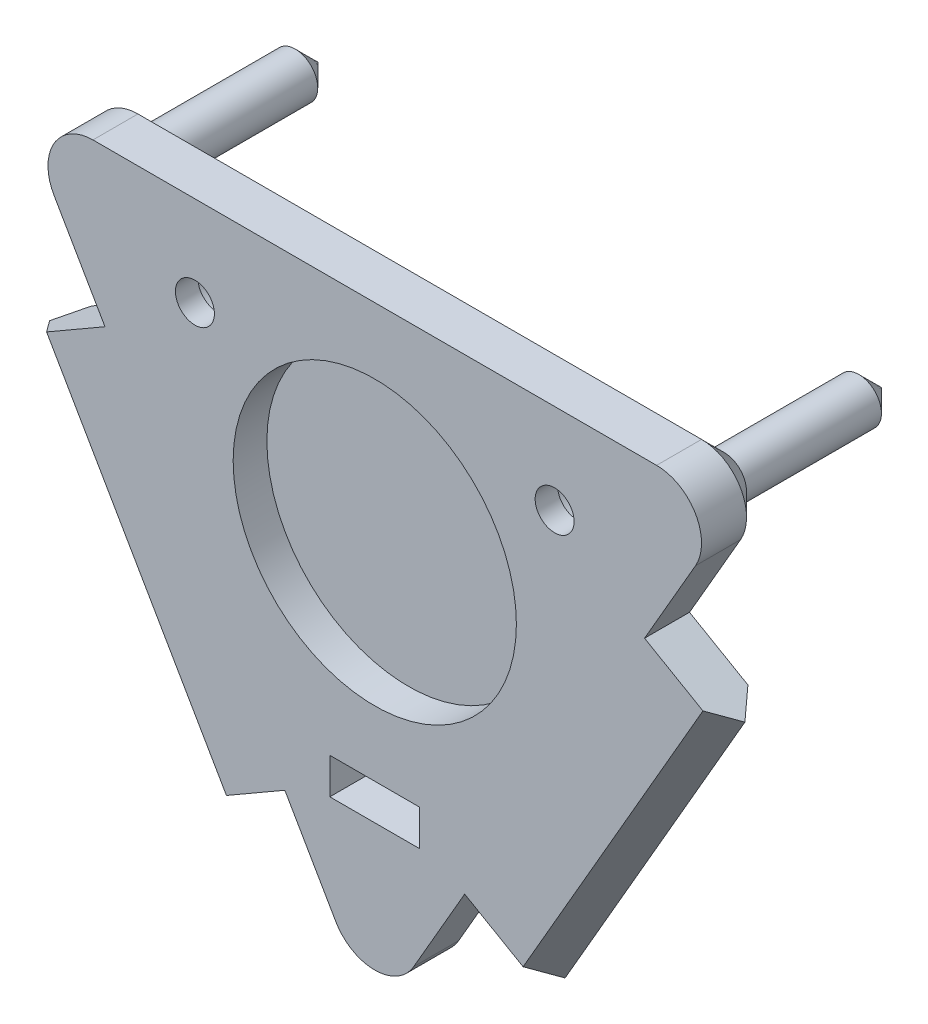
ISO-10303-21;
HEADER;
FILE_DESCRIPTION(('STEP AP214'),'2;1');
FILE_NAME('part.step','',(''),(''),'','','');
FILE_SCHEMA(('AUTOMOTIVE_DESIGN { 1 0 10303 214 1 1 1 1 }'));
ENDSEC;
DATA;
#1=APPLICATION_CONTEXT('core data for automotive mechanical design processes');
#2=APPLICATION_PROTOCOL_DEFINITION('international standard','automotive_design',2000,#1);
#3=PRODUCT_CONTEXT('',#1,'mechanical');
#4=PRODUCT('Part','Part','',(#3));
#5=PRODUCT_RELATED_PRODUCT_CATEGORY('part','',(#4));
#6=PRODUCT_DEFINITION_FORMATION('','',#4);
#7=PRODUCT_DEFINITION_CONTEXT('part definition',#1,'design');
#8=PRODUCT_DEFINITION('design','',#6,#7);
#9=PRODUCT_DEFINITION_SHAPE('','',#8);
#10=(LENGTH_UNIT() NAMED_UNIT(*) SI_UNIT(.MILLI.,.METRE.));
#11=(NAMED_UNIT(*) PLANE_ANGLE_UNIT() SI_UNIT($,.RADIAN.));
#12=(NAMED_UNIT(*) SI_UNIT($,.STERADIAN.) SOLID_ANGLE_UNIT());
#13=UNCERTAINTY_MEASURE_WITH_UNIT(LENGTH_MEASURE(1.E-05),#10,'distance_accuracy_value','');
#14=(GEOMETRIC_REPRESENTATION_CONTEXT(3) GLOBAL_UNCERTAINTY_ASSIGNED_CONTEXT((#13)) GLOBAL_UNIT_ASSIGNED_CONTEXT((#10,
#11,#12)) REPRESENTATION_CONTEXT('',''));
#15=CARTESIAN_POINT('',(0.,0.,0.));
#16=DIRECTION('',(0.,0.,1.));
#17=DIRECTION('',(1.,0.,0.));
#18=AXIS2_PLACEMENT_3D('',#15,#16,#17);
#19=CARTESIAN_POINT('',(50.7999999999999,29.329393674833,3.175));
#20=DIRECTION('',(-0.866025403784439,0.5,0.));
#21=DIRECTION('',(-0.5,-0.866025403784439,0.));
#22=AXIS2_PLACEMENT_3D('',#19,#20,#21);
#23=PLANE('',#22);
#24=DIRECTION('',(0.,0.,1.));
#25=VECTOR('',#24,1.);
#26=CARTESIAN_POINT('',(38.1000000000001,7.33234841870829,-65.2989076283128));
#27=LINE('',#26,#25);
#28=CARTESIAN_POINT('',(38.1000000000001,7.33234841870829,-3.175));
#29=VERTEX_POINT('',#28);
#30=CARTESIAN_POINT('',(38.1,7.33234841870833,3.175));
#31=VERTEX_POINT('',#30);
#32=EDGE_CURVE('E203',#29,#31,#27,.T.);
#33=ORIENTED_EDGE('',*,*,#32,.F.);
#34=DIRECTION('',(0.5,0.866025403784439,0.));
#35=VECTOR('',#34,1.);
#36=CARTESIAN_POINT('',(50.7999999999999,29.329393674833,-3.175));
#37=LINE('',#36,#35);
#38=CARTESIAN_POINT('',(45.3007386859688,19.804393674833,-3.175));
#39=VERTEX_POINT('',#38);
#40=EDGE_CURVE('E187',#29,#39,#37,.T.);
#41=ORIENTED_EDGE('',*,*,#40,.T.);
#42=DIRECTION('',(0.,0.,-1.));
#43=VECTOR('',#42,1.);
#44=CARTESIAN_POINT('',(45.3007386859688,19.804393674833,3.175));
#45=LINE('',#44,#43);
#46=CARTESIAN_POINT('',(45.3007386859688,19.804393674833,3.175));
#47=VERTEX_POINT('',#46);
#48=EDGE_CURVE('E322',#39,#47,#45,.F.);
#49=ORIENTED_EDGE('',*,*,#48,.T.);
#50=DIRECTION('',(0.5,0.866025403784439,0.));
#51=VECTOR('',#50,1.);
#52=CARTESIAN_POINT('',(50.7999999999999,29.329393674833,3.175));
#53=LINE('',#52,#51);
#54=EDGE_CURVE('E204',#31,#47,#53,.T.);
#55=ORIENTED_EDGE('',*,*,#54,.F.);
#56=EDGE_LOOP('',(#33,#41,#49,#55));
#57=FACE_BOUND('',#56,.T.);
#58=ADVANCED_FACE('F39',(#57),#23,.F.);
#59=DIRECTION('',(0.,0.,1.));
#60=VECTOR('',#59,1.);
#61=CARTESIAN_POINT('',(12.7000000000001,-36.6617420935412,-65.2989076283128));
#62=LINE('',#61,#60);
#63=CARTESIAN_POINT('',(12.7,-36.6617420935411,-3.175));
#64=VERTEX_POINT('',#63);
#65=CARTESIAN_POINT('',(12.7,-36.6617420935411,3.175));
#66=VERTEX_POINT('',#65);
#67=EDGE_CURVE('E210',#64,#66,#62,.T.);
#68=ORIENTED_EDGE('',*,*,#67,.T.);
#69=CARTESIAN_POINT('',(5.49926131403112,-49.133787349666,3.175));
#70=VERTEX_POINT('',#69);
#71=EDGE_CURVE('E288',#70,#66,#53,.T.);
#72=ORIENTED_EDGE('',*,*,#71,.F.);
#73=DIRECTION('',(0.,0.,-1.));
#74=VECTOR('',#73,1.);
#75=CARTESIAN_POINT('',(5.49926131403113,-49.133787349666,3.175));
#76=LINE('',#75,#74);
#77=CARTESIAN_POINT('',(5.49926131403112,-49.133787349666,-3.175));
#78=VERTEX_POINT('',#77);
#79=EDGE_CURVE('E324',#70,#78,#76,.T.);
#80=ORIENTED_EDGE('',*,*,#79,.T.);
#81=EDGE_CURVE('E199',#78,#64,#37,.T.);
#82=ORIENTED_EDGE('',*,*,#81,.T.);
#83=EDGE_LOOP('',(#68,#72,#80,#82));
#84=FACE_BOUND('',#83,.T.);
#85=ADVANCED_FACE('F397',(#84),#23,.F.);
#86=CARTESIAN_POINT('',(0.,-58.6587873496659,3.175));
#87=DIRECTION('',(0.866025403784439,0.5,0.));
#88=DIRECTION('',(-0.5,0.866025403784439,0.));
#89=AXIS2_PLACEMENT_3D('',#86,#87,#88);
#90=PLANE('',#89);
#91=DIRECTION('',(0.5,-0.866025403784439,0.));
#92=VECTOR('',#91,1.);
#93=CARTESIAN_POINT('',(0.,-58.6587873496659,3.175));
#94=LINE('',#93,#92);
#95=CARTESIAN_POINT('',(-12.7000000000001,-36.6617420935412,3.175));
#96=VERTEX_POINT('',#95);
#97=CARTESIAN_POINT('',(-5.49926131403124,-49.133787349666,3.175));
#98=VERTEX_POINT('',#97);
#99=EDGE_CURVE('E284',#96,#98,#94,.T.);
#100=ORIENTED_EDGE('',*,*,#99,.F.);
#101=DIRECTION('',(0.,0.,1.));
#102=VECTOR('',#101,1.);
#103=CARTESIAN_POINT('',(-12.7000000000001,-36.6617420935412,-65.2989076283128));
#104=LINE('',#103,#102);
#105=CARTESIAN_POINT('',(-12.7000000000001,-36.6617420935412,-3.175));
#106=VERTEX_POINT('',#105);
#107=EDGE_CURVE('E231',#106,#96,#104,.T.);
#108=ORIENTED_EDGE('',*,*,#107,.F.);
#109=DIRECTION('',(0.5,-0.866025403784439,0.));
#110=VECTOR('',#109,1.);
#111=CARTESIAN_POINT('',(0.,-58.6587873496659,-3.175));
#112=LINE('',#111,#110);
#113=CARTESIAN_POINT('',(-5.49926131403124,-49.133787349666,-3.175));
#114=VERTEX_POINT('',#113);
#115=EDGE_CURVE('E294',#106,#114,#112,.T.);
#116=ORIENTED_EDGE('',*,*,#115,.T.);
#117=DIRECTION('',(0.,0.,-1.));
#118=VECTOR('',#117,1.);
#119=CARTESIAN_POINT('',(-5.49926131403124,-49.133787349666,3.175));
#120=LINE('',#119,#118);
#121=EDGE_CURVE('E291',#114,#98,#120,.F.);
#122=ORIENTED_EDGE('',*,*,#121,.T.);
#123=EDGE_LOOP('',(#100,#108,#116,#122));
#124=FACE_BOUND('',#123,.T.);
#125=ADVANCED_FACE('F447',(#124),#90,.F.);
#126=CARTESIAN_POINT('',(25.4,16.629393674833,-28.575));
#127=DIRECTION('',(0.,0.,1.));
#128=DIRECTION('',(1.,0.,0.));
#129=AXIS2_PLACEMENT_3D('',#126,#127,#128);
#130=CYLINDRICAL_SURFACE('',#129,2.75);
#131=CARTESIAN_POINT('',(25.4,16.629393674833,3.175));
#132=DIRECTION('',(0.,0.,1.));
#133=DIRECTION('',(1.,0.,0.));
#134=AXIS2_PLACEMENT_3D('',#131,#132,#133);
#135=CIRCLE('',#134,2.75);
#136=CARTESIAN_POINT('',(28.15,16.629393674833,3.175));
#137=VERTEX_POINT('',#136);
#138=EDGE_CURVE('E251',#137,#137,#135,.T.);
#139=ORIENTED_EDGE('',*,*,#138,.T.);
#140=EDGE_LOOP('',(#139));
#141=FACE_BOUND('',#140,.T.);
#142=CARTESIAN_POINT('',(25.4,16.629393674833,0.));
#143=DIRECTION('',(0.,0.,-1.));
#144=DIRECTION('',(-1.,0.,0.));
#145=AXIS2_PLACEMENT_3D('',#142,#143,#144);
#146=CIRCLE('',#145,2.75);
#147=CARTESIAN_POINT('',(22.65,16.629393674833,0.));
#148=VERTEX_POINT('',#147);
#149=EDGE_CURVE('E254',#148,#148,#146,.F.);
#150=ORIENTED_EDGE('',*,*,#149,.F.);
#151=EDGE_LOOP('',(#150));
#152=FACE_BOUND('',#151,.T.);
#153=ADVANCED_FACE('F577',(#141,#152),#130,.F.);
#154=CARTESIAN_POINT('',(-25.4,16.629393674833,-28.575));
#155=DIRECTION('',(0.,0.,1.));
#156=DIRECTION('',(1.,0.,0.));
#157=AXIS2_PLACEMENT_3D('',#154,#155,#156);
#158=CYLINDRICAL_SURFACE('',#157,2.75);
#159=CARTESIAN_POINT('',(-25.4,16.629393674833,3.175));
#160=DIRECTION('',(0.,0.,1.));
#161=DIRECTION('',(1.,0.,0.));
#162=AXIS2_PLACEMENT_3D('',#159,#160,#161);
#163=CIRCLE('',#162,2.75);
#164=CARTESIAN_POINT('',(-22.65,16.629393674833,3.175));
#165=VERTEX_POINT('',#164);
#166=EDGE_CURVE('E247',#165,#165,#163,.T.);
#167=ORIENTED_EDGE('',*,*,#166,.T.);
#168=EDGE_LOOP('',(#167));
#169=FACE_BOUND('',#168,.T.);
#170=CARTESIAN_POINT('',(-25.4,16.629393674833,0.));
#171=DIRECTION('',(0.,0.,-1.));
#172=DIRECTION('',(-1.,0.,0.));
#173=AXIS2_PLACEMENT_3D('',#170,#171,#172);
#174=CIRCLE('',#173,2.75);
#175=CARTESIAN_POINT('',(-28.15,16.629393674833,0.));
#176=VERTEX_POINT('',#175);
#177=EDGE_CURVE('E238',#176,#176,#174,.F.);
#178=ORIENTED_EDGE('',*,*,#177,.F.);
#179=EDGE_LOOP('',(#178));
#180=FACE_BOUND('',#179,.T.);
#181=ADVANCED_FACE('F484',(#169,#180),#158,.F.);
#182=CARTESIAN_POINT('',(-50.8000000000001,29.329393674833,3.175));
#183=DIRECTION('',(0.,-1.,0.));
#184=DIRECTION('',(1.,0.,0.));
#185=AXIS2_PLACEMENT_3D('',#182,#183,#184);
#186=PLANE('',#185);
#187=DIRECTION('',(-1.,0.,0.));
#188=VECTOR('',#187,1.);
#189=CARTESIAN_POINT('',(-50.8000000000001,29.329393674833,-3.175));
#190=LINE('',#189,#188);
#191=CARTESIAN_POINT('',(39.8014773719376,29.329393674833,-3.175));
#192=VERTEX_POINT('',#191);
#193=CARTESIAN_POINT('',(-39.8014773719377,29.329393674833,-3.175));
#194=VERTEX_POINT('',#193);
#195=EDGE_CURVE('E280',#192,#194,#190,.T.);
#196=ORIENTED_EDGE('',*,*,#195,.T.);
#197=DIRECTION('',(0.,0.,-1.));
#198=VECTOR('',#197,1.);
#199=CARTESIAN_POINT('',(-39.8014773719377,29.329393674833,3.175));
#200=LINE('',#199,#198);
#201=CARTESIAN_POINT('',(-39.8014773719377,29.329393674833,3.175));
#202=VERTEX_POINT('',#201);
#203=EDGE_CURVE('E314',#194,#202,#200,.F.);
#204=ORIENTED_EDGE('',*,*,#203,.T.);
#205=DIRECTION('',(-1.,0.,0.));
#206=VECTOR('',#205,1.);
#207=CARTESIAN_POINT('',(-50.8000000000001,29.329393674833,3.175));
#208=LINE('',#207,#206);
#209=CARTESIAN_POINT('',(39.8014773719376,29.329393674833,3.175));
#210=VERTEX_POINT('',#209);
#211=EDGE_CURVE('E281',#210,#202,#208,.T.);
#212=ORIENTED_EDGE('',*,*,#211,.F.);
#213=DIRECTION('',(0.,0.,-1.));
#214=VECTOR('',#213,1.);
#215=CARTESIAN_POINT('',(39.8014773719376,29.329393674833,3.175));
#216=LINE('',#215,#214);
#217=EDGE_CURVE('E311',#210,#192,#216,.T.);
#218=ORIENTED_EDGE('',*,*,#217,.T.);
#219=EDGE_LOOP('',(#196,#204,#212,#218));
#220=FACE_BOUND('',#219,.T.);
#221=ADVANCED_FACE('F409',(#220),#186,.F.);
#222=CARTESIAN_POINT('',(-45.3007386859689,19.8043936748331,-3.175));
#223=VERTEX_POINT('',#222);
#224=CARTESIAN_POINT('',(-38.1000000000001,7.33234841870827,-3.175));
#225=VERTEX_POINT('',#224);
#226=EDGE_CURVE('E200',#223,#225,#112,.T.);
#227=ORIENTED_EDGE('',*,*,#226,.T.);
#228=DIRECTION('',(0.,0.,1.));
#229=VECTOR('',#228,1.);
#230=CARTESIAN_POINT('',(-38.1000000000001,7.33234841870829,-65.2989076283128));
#231=LINE('',#230,#229);
#232=CARTESIAN_POINT('',(-38.1000000000001,7.33234841870827,3.175));
#233=VERTEX_POINT('',#232);
#234=EDGE_CURVE('E229',#225,#233,#231,.T.);
#235=ORIENTED_EDGE('',*,*,#234,.T.);
#236=CARTESIAN_POINT('',(-45.3007386859689,19.8043936748331,3.175));
#237=VERTEX_POINT('',#236);
#238=EDGE_CURVE('E285',#237,#233,#94,.T.);
#239=ORIENTED_EDGE('',*,*,#238,.F.);
#240=DIRECTION('',(0.,0.,-1.));
#241=VECTOR('',#240,1.);
#242=CARTESIAN_POINT('',(-45.3007386859689,19.8043936748331,3.175));
#243=LINE('',#242,#241);
#244=EDGE_CURVE('E299',#237,#223,#243,.T.);
#245=ORIENTED_EDGE('',*,*,#244,.T.);
#246=EDGE_LOOP('',(#227,#235,#239,#245));
#247=FACE_BOUND('',#246,.T.);
#248=ADVANCED_FACE('F423',(#247),#90,.F.);
#249=CARTESIAN_POINT('',(0.,0.,3.175));
#250=DIRECTION('',(0.,0.,-1.));
#251=DIRECTION('',(-1.,0.,0.));
#252=AXIS2_PLACEMENT_3D('',#249,#250,#251);
#253=PLANE('',#252);
#254=ORIENTED_EDGE('',*,*,#166,.F.);
#255=EDGE_LOOP('',(#254));
#256=FACE_BOUND('',#255,.T.);
#257=ORIENTED_EDGE('',*,*,#138,.F.);
#258=EDGE_LOOP('',(#257));
#259=FACE_BOUND('',#258,.T.);
#260=DIRECTION('',(-1.,0.,0.));
#261=VECTOR('',#260,1.);
#262=CARTESIAN_POINT('',(-6.35,-29.21,3.175));
#263=LINE('',#262,#261);
#264=CARTESIAN_POINT('',(6.35,-29.21,3.175));
#265=VERTEX_POINT('',#264);
#266=CARTESIAN_POINT('',(-6.35,-29.21,3.175));
#267=VERTEX_POINT('',#266);
#268=EDGE_CURVE('E256',#265,#267,#263,.T.);
#269=ORIENTED_EDGE('',*,*,#268,.F.);
#270=DIRECTION('',(0.,1.,0.));
#271=VECTOR('',#270,1.);
#272=CARTESIAN_POINT('',(6.35,-34.29,3.175));
#273=LINE('',#272,#271);
#274=CARTESIAN_POINT('',(6.35,-34.29,3.175));
#275=VERTEX_POINT('',#274);
#276=EDGE_CURVE('E250',#275,#265,#273,.T.);
#277=ORIENTED_EDGE('',*,*,#276,.F.);
#278=DIRECTION('',(1.,0.,0.));
#279=VECTOR('',#278,1.);
#280=CARTESIAN_POINT('',(-6.35,-34.29,3.175));
#281=LINE('',#280,#279);
#282=CARTESIAN_POINT('',(-6.35,-34.29,3.175));
#283=VERTEX_POINT('',#282);
#284=EDGE_CURVE('E262',#283,#275,#281,.T.);
#285=ORIENTED_EDGE('',*,*,#284,.F.);
#286=DIRECTION('',(0.,-1.,0.));
#287=VECTOR('',#286,1.);
#288=CARTESIAN_POINT('',(-6.35,-34.29,3.175));
#289=LINE('',#288,#287);
#290=EDGE_CURVE('E259',#267,#283,#289,.T.);
#291=ORIENTED_EDGE('',*,*,#290,.F.);
#292=EDGE_LOOP('',(#269,#277,#285,#291));
#293=FACE_BOUND('',#292,.T.);
#294=CARTESIAN_POINT('',(0.,0.,3.175));
#295=DIRECTION('',(0.,0.,1.));
#296=DIRECTION('',(1.,0.,0.));
#297=AXIS2_PLACEMENT_3D('',#294,#295,#296);
#298=CIRCLE('',#297,20.);
#299=CARTESIAN_POINT('',(20.,0.,3.175));
#300=VERTEX_POINT('',#299);
#301=EDGE_CURVE('E268',#300,#300,#298,.T.);
#302=ORIENTED_EDGE('',*,*,#301,.F.);
#303=EDGE_LOOP('',(#302));
#304=FACE_BOUND('',#303,.T.);
#305=DIRECTION('',(-0.866025403784438,0.500000000000001,0.));
#306=VECTOR('',#305,1.);
#307=CARTESIAN_POINT('',(23.6985226280624,-43.0117420935412,3.175));
#308=LINE('',#307,#306);
#309=CARTESIAN_POINT('',(20.9488919710468,-41.4242420935412,3.175));
#310=VERTEX_POINT('',#309);
#311=EDGE_CURVE('E215',#310,#66,#308,.T.);
#312=ORIENTED_EDGE('',*,*,#311,.F.);
#313=DIRECTION('',(0.5,0.866025403784439,0.));
#314=VECTOR('',#313,1.);
#315=CARTESIAN_POINT('',(33.6488919710468,-19.4271968374165,3.175));
#316=LINE('',#315,#314);
#317=CARTESIAN_POINT('',(46.3488919710468,2.5698484187083,3.175));
#318=VERTEX_POINT('',#317);
#319=EDGE_CURVE('E12',#310,#318,#316,.T.);
#320=ORIENTED_EDGE('',*,*,#319,.T.);
#321=DIRECTION('',(0.866025403784439,-0.5,0.));
#322=VECTOR('',#321,1.);
#323=CARTESIAN_POINT('',(49.0985226280624,0.982348418708289,3.175));
#324=LINE('',#323,#322);
#325=EDGE_CURVE('E205',#31,#318,#324,.T.);
#326=ORIENTED_EDGE('',*,*,#325,.F.);
#327=ORIENTED_EDGE('',*,*,#54,.T.);
#328=CARTESIAN_POINT('',(39.8014773719376,22.979393674833,3.175));
#329=DIRECTION('',(0.,0.,-1.));
#330=DIRECTION('',(-1.,0.,0.));
#331=AXIS2_PLACEMENT_3D('',#328,#329,#330);
#332=CIRCLE('',#331,6.35);
#333=EDGE_CURVE('E316',#47,#210,#332,.F.);
#334=ORIENTED_EDGE('',*,*,#333,.T.);
#335=ORIENTED_EDGE('',*,*,#211,.T.);
#336=CARTESIAN_POINT('',(-39.8014773719377,22.9793936748331,3.175));
#337=DIRECTION('',(0.,0.,-1.));
#338=DIRECTION('',(-1.,0.,0.));
#339=AXIS2_PLACEMENT_3D('',#336,#337,#338);
#340=CIRCLE('',#339,6.35);
#341=EDGE_CURVE('E320',#202,#237,#340,.F.);
#342=ORIENTED_EDGE('',*,*,#341,.T.);
#343=ORIENTED_EDGE('',*,*,#238,.T.);
#344=DIRECTION('',(-0.866025403784439,-0.5,0.));
#345=VECTOR('',#344,1.);
#346=CARTESIAN_POINT('',(-49.0985226280624,0.982348418708289,3.175));
#347=LINE('',#346,#345);
#348=CARTESIAN_POINT('',(-46.3488919710468,2.5698484187083,3.175));
#349=VERTEX_POINT('',#348);
#350=EDGE_CURVE('E222',#233,#349,#347,.T.);
#351=ORIENTED_EDGE('',*,*,#350,.T.);
#352=DIRECTION('',(0.5,-0.866025403784439,0.));
#353=VECTOR('',#352,1.);
#354=CARTESIAN_POINT('',(-20.9488919710468,-41.4242420935412,3.175));
#355=LINE('',#354,#353);
#356=CARTESIAN_POINT('',(-20.9488919710468,-41.4242420935412,3.175));
#357=VERTEX_POINT('',#356);
#358=EDGE_CURVE('E375',#349,#357,#355,.T.);
#359=ORIENTED_EDGE('',*,*,#358,.T.);
#360=DIRECTION('',(0.866025403784438,0.500000000000001,0.));
#361=VECTOR('',#360,1.);
#362=CARTESIAN_POINT('',(-23.6985226280624,-43.0117420935412,3.175));
#363=LINE('',#362,#361);
#364=EDGE_CURVE('E219',#357,#96,#363,.T.);
#365=ORIENTED_EDGE('',*,*,#364,.T.);
#366=ORIENTED_EDGE('',*,*,#99,.T.);
#367=CARTESIAN_POINT('',(0.,-45.958787349666,3.175));
#368=DIRECTION('',(0.,0.,-1.));
#369=DIRECTION('',(-1.,0.,0.));
#370=AXIS2_PLACEMENT_3D('',#367,#368,#369);
#371=CIRCLE('',#370,6.35);
#372=EDGE_CURVE('E318',#98,#70,#371,.F.);
#373=ORIENTED_EDGE('',*,*,#372,.T.);
#374=ORIENTED_EDGE('',*,*,#71,.T.);
#375=EDGE_LOOP('',(#312,#320,#326,#327,#334,#335,#342,#343,#351,#359,#365,#366,#373,#374));
#376=FACE_BOUND('',#375,.T.);
#377=ADVANCED_FACE('F401',(#256,#259,#293,#304,#376),#253,.F.);
#378=CARTESIAN_POINT('',(0.,0.,-3.175));
#379=DIRECTION('',(0.,0.,-1.));
#380=DIRECTION('',(-1.,0.,0.));
#381=AXIS2_PLACEMENT_3D('',#378,#379,#380);
#382=PLANE('',#381);
#383=CARTESIAN_POINT('',(25.4,16.629393674833,-3.175));
#384=DIRECTION('',(0.,0.,-1.));
#385=DIRECTION('',(-1.,0.,0.));
#386=AXIS2_PLACEMENT_3D('',#383,#384,#385);
#387=CIRCLE('',#386,5.);
#388=CARTESIAN_POINT('',(20.4,16.629393674833,-3.175));
#389=VERTEX_POINT('',#388);
#390=EDGE_CURVE('E239',#389,#389,#387,.T.);
#391=ORIENTED_EDGE('',*,*,#390,.F.);
#392=EDGE_LOOP('',(#391));
#393=FACE_BOUND('',#392,.T.);
#394=CARTESIAN_POINT('',(-25.4,16.629393674833,-3.175));
#395=DIRECTION('',(0.,0.,-1.));
#396=DIRECTION('',(-1.,0.,0.));
#397=AXIS2_PLACEMENT_3D('',#394,#395,#396);
#398=CIRCLE('',#397,5.);
#399=CARTESIAN_POINT('',(-30.4,16.629393674833,-3.175));
#400=VERTEX_POINT('',#399);
#401=EDGE_CURVE('E228',#400,#400,#398,.T.);
#402=ORIENTED_EDGE('',*,*,#401,.F.);
#403=EDGE_LOOP('',(#402));
#404=FACE_BOUND('',#403,.T.);
#405=DIRECTION('',(0.,-1.,0.));
#406=VECTOR('',#405,1.);
#407=CARTESIAN_POINT('',(6.35,0.,-3.175));
#408=LINE('',#407,#406);
#409=CARTESIAN_POINT('',(6.35,-29.21,-3.175));
#410=VERTEX_POINT('',#409);
#411=CARTESIAN_POINT('',(6.35,-34.29,-3.175));
#412=VERTEX_POINT('',#411);
#413=EDGE_CURVE('E358',#410,#412,#408,.T.);
#414=ORIENTED_EDGE('',*,*,#413,.F.);
#415=DIRECTION('',(1.,0.,0.));
#416=VECTOR('',#415,1.);
#417=CARTESIAN_POINT('',(0.,-29.21,-3.175));
#418=LINE('',#417,#416);
#419=CARTESIAN_POINT('',(-6.35,-29.21,-3.175));
#420=VERTEX_POINT('',#419);
#421=EDGE_CURVE('E351',#420,#410,#418,.T.);
#422=ORIENTED_EDGE('',*,*,#421,.F.);
#423=DIRECTION('',(0.,1.,0.));
#424=VECTOR('',#423,1.);
#425=CARTESIAN_POINT('',(-6.35,0.,-3.175));
#426=LINE('',#425,#424);
#427=CARTESIAN_POINT('',(-6.35,-34.29,-3.175));
#428=VERTEX_POINT('',#427);
#429=EDGE_CURVE('E353',#428,#420,#426,.T.);
#430=ORIENTED_EDGE('',*,*,#429,.F.);
#431=DIRECTION('',(-1.,0.,0.));
#432=VECTOR('',#431,1.);
#433=CARTESIAN_POINT('',(0.,-34.29,-3.175));
#434=LINE('',#433,#432);
#435=EDGE_CURVE('E356',#412,#428,#434,.T.);
#436=ORIENTED_EDGE('',*,*,#435,.F.);
#437=EDGE_LOOP('',(#414,#422,#430,#436));
#438=FACE_BOUND('',#437,.T.);
#439=DIRECTION('',(0.866025403784439,-0.5,0.));
#440=VECTOR('',#439,1.);
#441=CARTESIAN_POINT('',(49.0985226280624,0.982348418708289,-3.175));
#442=LINE('',#441,#440);
#443=CARTESIAN_POINT('',(46.3488919710468,2.56984841870831,-3.175));
#444=VERTEX_POINT('',#443);
#445=EDGE_CURVE('E192',#29,#444,#442,.T.);
#446=ORIENTED_EDGE('',*,*,#445,.T.);
#447=DIRECTION('',(-0.5,-0.866025403784439,0.));
#448=VECTOR('',#447,1.);
#449=CARTESIAN_POINT('',(20.9488919710468,-41.4242420935412,-3.175));
#450=LINE('',#449,#448);
#451=CARTESIAN_POINT('',(20.9488919710468,-41.4242420935412,-3.175));
#452=VERTEX_POINT('',#451);
#453=EDGE_CURVE('E377',#444,#452,#450,.T.);
#454=ORIENTED_EDGE('',*,*,#453,.T.);
#455=DIRECTION('',(-0.866025403784438,0.500000000000001,0.));
#456=VECTOR('',#455,1.);
#457=CARTESIAN_POINT('',(23.6985226280624,-43.0117420935412,-3.175));
#458=LINE('',#457,#456);
#459=EDGE_CURVE('E209',#452,#64,#458,.T.);
#460=ORIENTED_EDGE('',*,*,#459,.T.);
#461=ORIENTED_EDGE('',*,*,#81,.F.);
#462=CARTESIAN_POINT('',(0.,-45.958787349666,-3.175));
#463=DIRECTION('',(0.,0.,-1.));
#464=DIRECTION('',(-1.,0.,0.));
#465=AXIS2_PLACEMENT_3D('',#462,#463,#464);
#466=CIRCLE('',#465,6.34999999999998);
#467=EDGE_CURVE('E330',#78,#114,#466,.F.);
#468=ORIENTED_EDGE('',*,*,#467,.T.);
#469=ORIENTED_EDGE('',*,*,#115,.F.);
#470=DIRECTION('',(0.866025403784438,0.500000000000001,0.));
#471=VECTOR('',#470,1.);
#472=CARTESIAN_POINT('',(-23.6985226280624,-43.0117420935412,-3.175));
#473=LINE('',#472,#471);
#474=CARTESIAN_POINT('',(-20.9488919710468,-41.4242420935412,-3.175));
#475=VERTEX_POINT('',#474);
#476=EDGE_CURVE('E221',#475,#106,#473,.T.);
#477=ORIENTED_EDGE('',*,*,#476,.F.);
#478=DIRECTION('',(-0.5,0.866025403784439,0.));
#479=VECTOR('',#478,1.);
#480=CARTESIAN_POINT('',(-33.6488919710468,-19.4271968374165,-3.175));
#481=LINE('',#480,#479);
#482=CARTESIAN_POINT('',(-46.3488919710468,2.5698484187083,-3.175));
#483=VERTEX_POINT('',#482);
#484=EDGE_CURVE('E368',#475,#483,#481,.T.);
#485=ORIENTED_EDGE('',*,*,#484,.T.);
#486=DIRECTION('',(-0.866025403784439,-0.5,0.));
#487=VECTOR('',#486,1.);
#488=CARTESIAN_POINT('',(-49.0985226280624,0.982348418708289,-3.175));
#489=LINE('',#488,#487);
#490=EDGE_CURVE('E225',#225,#483,#489,.T.);
#491=ORIENTED_EDGE('',*,*,#490,.F.);
#492=ORIENTED_EDGE('',*,*,#226,.F.);
#493=CARTESIAN_POINT('',(-39.8014773719378,22.9793936748327,-3.175));
#494=DIRECTION('',(0.,0.,-1.));
#495=DIRECTION('',(-1.,0.,0.));
#496=AXIS2_PLACEMENT_3D('',#493,#494,#495);
#497=CIRCLE('',#496,6.34999999999999);
#498=EDGE_CURVE('E343',#223,#194,#497,.F.);
#499=ORIENTED_EDGE('',*,*,#498,.T.);
#500=ORIENTED_EDGE('',*,*,#195,.F.);
#501=CARTESIAN_POINT('',(39.8014773719376,22.9793936748331,-3.175));
#502=DIRECTION('',(0.,0.,-1.));
#503=DIRECTION('',(-1.,0.,0.));
#504=AXIS2_PLACEMENT_3D('',#501,#502,#503);
#505=CIRCLE('',#504,6.35);
#506=EDGE_CURVE('E195',#192,#39,#505,.F.);
#507=ORIENTED_EDGE('',*,*,#506,.T.);
#508=ORIENTED_EDGE('',*,*,#40,.F.);
#509=EDGE_LOOP('',(#446,#454,#460,#461,#468,#469,#477,#485,#491,#492,#499,#500,#507,#508));
#510=FACE_BOUND('',#509,.T.);
#511=ADVANCED_FACE('F189',(#393,#404,#438,#510),#382,.T.);
#512=CARTESIAN_POINT('',(-39.8014773719377,22.9793936748331,3.175));
#513=DIRECTION('',(0.,0.,-1.));
#514=DIRECTION('',(-1.,0.,0.));
#515=AXIS2_PLACEMENT_3D('',#512,#513,#514);
#516=CYLINDRICAL_SURFACE('',#515,6.35);
#517=ORIENTED_EDGE('',*,*,#341,.F.);
#518=ORIENTED_EDGE('',*,*,#203,.F.);
#519=CARTESIAN_POINT('',(-39.8014773719377,22.9793936748331,-3.175));
#520=DIRECTION('',(0.,0.,-1.));
#521=DIRECTION('',(-1.,0.,0.));
#522=AXIS2_PLACEMENT_3D('',#519,#520,#521);
#523=CIRCLE('',#522,6.35);
#524=EDGE_CURVE('E308',#223,#194,#523,.T.);
#525=ORIENTED_EDGE('',*,*,#524,.F.);
#526=ORIENTED_EDGE('',*,*,#244,.F.);
#527=EDGE_LOOP('',(#517,#518,#525,#526));
#528=FACE_BOUND('',#527,.T.);
#529=ADVANCED_FACE('F420',(#528),#516,.T.);
#530=CARTESIAN_POINT('',(0.,-45.958787349666,3.175));
#531=DIRECTION('',(0.,0.,-1.));
#532=DIRECTION('',(-1.,0.,0.));
#533=AXIS2_PLACEMENT_3D('',#530,#531,#532);
#534=CYLINDRICAL_SURFACE('',#533,6.35);
#535=ORIENTED_EDGE('',*,*,#372,.F.);
#536=ORIENTED_EDGE('',*,*,#121,.F.);
#537=CARTESIAN_POINT('',(0.,-45.958787349666,-3.175));
#538=DIRECTION('',(0.,0.,-1.));
#539=DIRECTION('',(-1.,0.,0.));
#540=AXIS2_PLACEMENT_3D('',#537,#538,#539);
#541=CIRCLE('',#540,6.35);
#542=EDGE_CURVE('E305',#78,#114,#541,.T.);
#543=ORIENTED_EDGE('',*,*,#542,.F.);
#544=ORIENTED_EDGE('',*,*,#79,.F.);
#545=EDGE_LOOP('',(#535,#536,#543,#544));
#546=FACE_BOUND('',#545,.T.);
#547=ADVANCED_FACE('F451',(#546),#534,.T.);
#548=CARTESIAN_POINT('',(39.8014773719376,22.979393674833,3.175));
#549=DIRECTION('',(0.,0.,-1.));
#550=DIRECTION('',(-1.,0.,0.));
#551=AXIS2_PLACEMENT_3D('',#548,#549,#550);
#552=CYLINDRICAL_SURFACE('',#551,6.35);
#553=ORIENTED_EDGE('',*,*,#333,.F.);
#554=ORIENTED_EDGE('',*,*,#48,.F.);
#555=CARTESIAN_POINT('',(39.8014773719376,22.979393674833,-3.175));
#556=DIRECTION('',(0.,0.,-1.));
#557=DIRECTION('',(-1.,0.,0.));
#558=AXIS2_PLACEMENT_3D('',#555,#556,#557);
#559=CIRCLE('',#558,6.35);
#560=EDGE_CURVE('E302',#192,#39,#559,.T.);
#561=ORIENTED_EDGE('',*,*,#560,.F.);
#562=ORIENTED_EDGE('',*,*,#217,.F.);
#563=EDGE_LOOP('',(#553,#554,#561,#562));
#564=FACE_BOUND('',#563,.T.);
#565=ADVANCED_FACE('F407',(#564),#552,.T.);
#566=CARTESIAN_POINT('',(0.,0.,-1.5875));
#567=DIRECTION('',(0.,0.,-1.));
#568=DIRECTION('',(-1.,0.,0.));
#569=AXIS2_PLACEMENT_3D('',#566,#567,#568);
#570=PLANE('',#569);
#571=CARTESIAN_POINT('',(0.,0.,-1.5875));
#572=DIRECTION('',(0.,0.,-1.));
#573=DIRECTION('',(-1.,0.,0.));
#574=AXIS2_PLACEMENT_3D('',#571,#572,#573);
#575=CIRCLE('',#574,20.);
#576=CARTESIAN_POINT('',(-20.,0.,-1.5875));
#577=VERTEX_POINT('',#576);
#578=EDGE_CURVE('E277',#577,#577,#575,.F.);
#579=ORIENTED_EDGE('',*,*,#578,.T.);
#580=EDGE_LOOP('',(#579));
#581=FACE_BOUND('',#580,.T.);
#582=ADVANCED_FACE('F468',(#581),#570,.F.);
#583=CARTESIAN_POINT('',(0.,0.,-59.7435424949238));
#584=DIRECTION('',(0.,0.,1.));
#585=DIRECTION('',(1.,0.,0.));
#586=AXIS2_PLACEMENT_3D('',#583,#584,#585);
#587=CYLINDRICAL_SURFACE('',#586,20.);
#588=ORIENTED_EDGE('',*,*,#301,.T.);
#589=EDGE_LOOP('',(#588));
#590=FACE_BOUND('',#589,.T.);
#591=ORIENTED_EDGE('',*,*,#578,.F.);
#592=EDGE_LOOP('',(#591));
#593=FACE_BOUND('',#592,.T.);
#594=ADVANCED_FACE('F462',(#590,#593),#587,.F.);
#595=CARTESIAN_POINT('',(0.,-45.958787349666,-28.575));
#596=DIRECTION('',(0.,0.,1.));
#597=DIRECTION('',(1.,0.,0.));
#598=AXIS2_PLACEMENT_3D('',#595,#596,#597);
#599=CYLINDRICAL_SURFACE('',#598,3.175);
#600=CARTESIAN_POINT('',(0.,-45.958787349666,-25.4));
#601=DIRECTION('',(0.,0.,-1.));
#602=DIRECTION('',(-1.,0.,0.));
#603=AXIS2_PLACEMENT_3D('',#600,#601,#602);
#604=CIRCLE('',#603,3.175);
#605=CARTESIAN_POINT('',(-3.17500000000006,-45.958787349666,-25.4));
#606=VERTEX_POINT('',#605);
#607=EDGE_CURVE('E333',#606,#606,#604,.F.);
#608=ORIENTED_EDGE('',*,*,#607,.T.);
#609=EDGE_LOOP('',(#608));
#610=FACE_BOUND('',#609,.T.);
#611=CARTESIAN_POINT('',(0.,-45.958787349666,-6.35000000000002));
#612=DIRECTION('',(0.,0.,-1.));
#613=DIRECTION('',(-1.,0.,0.));
#614=AXIS2_PLACEMENT_3D('',#611,#612,#613);
#615=CIRCLE('',#614,3.175);
#616=CARTESIAN_POINT('',(-3.17500000000006,-45.958787349666,-6.35000000000002));
#617=VERTEX_POINT('',#616);
#618=EDGE_CURVE('E327',#617,#617,#615,.T.);
#619=ORIENTED_EDGE('',*,*,#618,.T.);
#620=EDGE_LOOP('',(#619));
#621=FACE_BOUND('',#620,.T.);
#622=ADVANCED_FACE('F457',(#610,#621),#599,.T.);
#623=CARTESIAN_POINT('',(0.,-45.958787349666,-6.35000000000002));
#624=DIRECTION('',(0.,0.,1.));
#625=DIRECTION('',(1.,0.,0.));
#626=AXIS2_PLACEMENT_3D('',#623,#624,#625);
#627=CONICAL_SURFACE('',#626,3.175,0.785398163397443);
#628=ORIENTED_EDGE('',*,*,#467,.F.);
#629=ORIENTED_EDGE('',*,*,#542,.T.);
#630=EDGE_LOOP('',(#628,#629));
#631=FACE_BOUND('',#630,.T.);
#632=ORIENTED_EDGE('',*,*,#618,.F.);
#633=EDGE_LOOP('',(#632));
#634=FACE_BOUND('',#633,.T.);
#635=ADVANCED_FACE('F453',(#631,#634),#627,.T.);
#636=CARTESIAN_POINT('',(0.,-45.958787349666,-25.4));
#637=DIRECTION('',(0.,0.,1.));
#638=DIRECTION('',(1.,0.,0.));
#639=AXIS2_PLACEMENT_3D('',#636,#637,#638);
#640=CONICAL_SURFACE('',#639,3.17500000000001,0.785398163397444);
#641=ORIENTED_EDGE('',*,*,#607,.F.);
#642=EDGE_LOOP('',(#641));
#643=FACE_BOUND('',#642,.T.);
#644=CARTESIAN_POINT('',(0.,-45.958787349666,-28.575));
#645=VERTEX_POINT('',#644);
#646=VERTEX_LOOP('',#645);
#647=FACE_BOUND('',#646,.T.);
#648=ADVANCED_FACE('F456',(#643,#647),#640,.T.);
#649=CARTESIAN_POINT('',(39.8014773719376,22.9793936748331,-28.575));
#650=DIRECTION('',(0.,0.,1.));
#651=DIRECTION('',(1.,0.,0.));
#652=AXIS2_PLACEMENT_3D('',#649,#650,#651);
#653=CYLINDRICAL_SURFACE('',#652,3.175);
#654=CARTESIAN_POINT('',(39.8014773719376,22.9793936748331,-25.4));
#655=DIRECTION('',(0.,0.,-1.));
#656=DIRECTION('',(-1.,0.,0.));
#657=AXIS2_PLACEMENT_3D('',#654,#655,#656);
#658=CIRCLE('',#657,3.175);
#659=CARTESIAN_POINT('',(36.6264773719376,22.9793936748331,-25.4));
#660=VERTEX_POINT('',#659);
#661=EDGE_CURVE('E345',#660,#660,#658,.F.);
#662=ORIENTED_EDGE('',*,*,#661,.T.);
#663=EDGE_LOOP('',(#662));
#664=FACE_BOUND('',#663,.T.);
#665=CARTESIAN_POINT('',(39.8014773719376,22.9793936748331,-6.35000000000005));
#666=DIRECTION('',(0.,0.,-1.));
#667=DIRECTION('',(-1.,0.,0.));
#668=AXIS2_PLACEMENT_3D('',#665,#666,#667);
#669=CIRCLE('',#668,3.175);
#670=CARTESIAN_POINT('',(36.6264773719376,22.9793936748331,-6.35000000000005));
#671=VERTEX_POINT('',#670);
#672=EDGE_CURVE('E336',#671,#671,#669,.T.);
#673=ORIENTED_EDGE('',*,*,#672,.T.);
#674=EDGE_LOOP('',(#673));
#675=FACE_BOUND('',#674,.T.);
#676=ADVANCED_FACE('F500',(#664,#675),#653,.T.);
#677=CARTESIAN_POINT('',(-39.8014773719378,22.9793936748327,-28.575));
#678=DIRECTION('',(0.,0.,1.));
#679=DIRECTION('',(1.,0.,0.));
#680=AXIS2_PLACEMENT_3D('',#677,#678,#679);
#681=CYLINDRICAL_SURFACE('',#680,3.175);
#682=CARTESIAN_POINT('',(-39.8014773719378,22.9793936748327,-25.4));
#683=DIRECTION('',(0.,0.,-1.));
#684=DIRECTION('',(-1.,0.,0.));
#685=AXIS2_PLACEMENT_3D('',#682,#683,#684);
#686=CIRCLE('',#685,3.175);
#687=CARTESIAN_POINT('',(-42.9764773719378,22.9793936748327,-25.4));
#688=VERTEX_POINT('',#687);
#689=EDGE_CURVE('E348',#688,#688,#686,.F.);
#690=ORIENTED_EDGE('',*,*,#689,.T.);
#691=EDGE_LOOP('',(#690));
#692=FACE_BOUND('',#691,.T.);
#693=CARTESIAN_POINT('',(-39.8014773719378,22.9793936748327,-6.35000000000002));
#694=DIRECTION('',(0.,0.,-1.));
#695=DIRECTION('',(-1.,0.,0.));
#696=AXIS2_PLACEMENT_3D('',#693,#694,#695);
#697=CIRCLE('',#696,3.175);
#698=CARTESIAN_POINT('',(-42.9764773719378,22.9793936748327,-6.35000000000002));
#699=VERTEX_POINT('',#698);
#700=EDGE_CURVE('E340',#699,#699,#697,.T.);
#701=ORIENTED_EDGE('',*,*,#700,.T.);
#702=EDGE_LOOP('',(#701));
#703=FACE_BOUND('',#702,.T.);
#704=ADVANCED_FACE('F508',(#692,#703),#681,.T.);
#705=CARTESIAN_POINT('',(39.8014773719376,22.9793936748331,-6.35000000000005));
#706=DIRECTION('',(0.,0.,1.));
#707=DIRECTION('',(1.,0.,0.));
#708=AXIS2_PLACEMENT_3D('',#705,#706,#707);
#709=CONICAL_SURFACE('',#708,3.175,0.785398163397441);
#710=ORIENTED_EDGE('',*,*,#506,.F.);
#711=ORIENTED_EDGE('',*,*,#560,.T.);
#712=EDGE_LOOP('',(#710,#711));
#713=FACE_BOUND('',#712,.T.);
#714=ORIENTED_EDGE('',*,*,#672,.F.);
#715=EDGE_LOOP('',(#714));
#716=FACE_BOUND('',#715,.T.);
#717=ADVANCED_FACE('F502',(#713,#716),#709,.T.);
#718=CARTESIAN_POINT('',(-39.8014773719378,22.9793936748327,-6.35000000000002));
#719=DIRECTION('',(0.,0.,1.));
#720=DIRECTION('',(1.,0.,0.));
#721=AXIS2_PLACEMENT_3D('',#718,#719,#720);
#722=CONICAL_SURFACE('',#721,3.175,0.785398163397443);
#723=ORIENTED_EDGE('',*,*,#498,.F.);
#724=ORIENTED_EDGE('',*,*,#524,.T.);
#725=EDGE_LOOP('',(#723,#724));
#726=FACE_BOUND('',#725,.T.);
#727=ORIENTED_EDGE('',*,*,#700,.F.);
#728=EDGE_LOOP('',(#727));
#729=FACE_BOUND('',#728,.T.);
#730=ADVANCED_FACE('F415',(#726,#729),#722,.T.);
#731=CARTESIAN_POINT('',(39.8014773719376,22.9793936748331,-25.4));
#732=DIRECTION('',(0.,0.,1.));
#733=DIRECTION('',(1.,0.,0.));
#734=AXIS2_PLACEMENT_3D('',#731,#732,#733);
#735=CONICAL_SURFACE('',#734,3.175,0.785398163397446);
#736=ORIENTED_EDGE('',*,*,#661,.F.);
#737=EDGE_LOOP('',(#736));
#738=FACE_BOUND('',#737,.T.);
#739=CARTESIAN_POINT('',(39.8014773719376,22.9793936748331,-28.575));
#740=VERTEX_POINT('',#739);
#741=VERTEX_LOOP('',#740);
#742=FACE_BOUND('',#741,.T.);
#743=ADVANCED_FACE('F515',(#738,#742),#735,.T.);
#744=CARTESIAN_POINT('',(-39.8014773719378,22.9793936748327,-25.4));
#745=DIRECTION('',(0.,0.,1.));
#746=DIRECTION('',(1.,0.,0.));
#747=AXIS2_PLACEMENT_3D('',#744,#745,#746);
#748=CONICAL_SURFACE('',#747,3.17500000000002,0.785398163397446);
#749=ORIENTED_EDGE('',*,*,#689,.F.);
#750=EDGE_LOOP('',(#749));
#751=FACE_BOUND('',#750,.T.);
#752=CARTESIAN_POINT('',(-39.8014773719378,22.9793936748327,-28.575));
#753=VERTEX_POINT('',#752);
#754=VERTEX_LOOP('',#753);
#755=FACE_BOUND('',#754,.T.);
#756=ADVANCED_FACE('F521',(#751,#755),#748,.T.);
#757=CARTESIAN_POINT('',(6.35,-34.29,-28.575));
#758=DIRECTION('',(1.,0.,0.));
#759=DIRECTION('',(0.,0.,-1.));
#760=AXIS2_PLACEMENT_3D('',#757,#758,#759);
#761=PLANE('',#760);
#762=ORIENTED_EDGE('',*,*,#413,.T.);
#763=DIRECTION('',(0.,0.,1.));
#764=VECTOR('',#763,1.);
#765=CARTESIAN_POINT('',(6.35,-34.29,-28.575));
#766=LINE('',#765,#764);
#767=EDGE_CURVE('E266',#412,#275,#766,.T.);
#768=ORIENTED_EDGE('',*,*,#767,.T.);
#769=ORIENTED_EDGE('',*,*,#276,.T.);
#770=DIRECTION('',(0.,0.,1.));
#771=VECTOR('',#770,1.);
#772=CARTESIAN_POINT('',(6.35,-29.21,-28.575));
#773=LINE('',#772,#771);
#774=EDGE_CURVE('E265',#410,#265,#773,.T.);
#775=ORIENTED_EDGE('',*,*,#774,.F.);
#776=EDGE_LOOP('',(#762,#768,#769,#775));
#777=FACE_BOUND('',#776,.T.);
#778=ADVANCED_FACE('F528',(#777),#761,.F.);
#779=CARTESIAN_POINT('',(-6.35,-34.29,-28.575));
#780=DIRECTION('',(0.,-1.,0.));
#781=DIRECTION('',(0.,0.,-1.));
#782=AXIS2_PLACEMENT_3D('',#779,#780,#781);
#783=PLANE('',#782);
#784=ORIENTED_EDGE('',*,*,#435,.T.);
#785=DIRECTION('',(0.,0.,1.));
#786=VECTOR('',#785,1.);
#787=CARTESIAN_POINT('',(-6.35,-34.29,-28.575));
#788=LINE('',#787,#786);
#789=EDGE_CURVE('E269',#428,#283,#788,.T.);
#790=ORIENTED_EDGE('',*,*,#789,.T.);
#791=ORIENTED_EDGE('',*,*,#284,.T.);
#792=ORIENTED_EDGE('',*,*,#767,.F.);
#793=EDGE_LOOP('',(#784,#790,#791,#792));
#794=FACE_BOUND('',#793,.T.);
#795=ADVANCED_FACE('F582',(#794),#783,.F.);
#796=CARTESIAN_POINT('',(-6.35,-34.29,-28.575));
#797=DIRECTION('',(-1.,0.,0.));
#798=DIRECTION('',(0.,0.,1.));
#799=AXIS2_PLACEMENT_3D('',#796,#797,#798);
#800=PLANE('',#799);
#801=ORIENTED_EDGE('',*,*,#429,.T.);
#802=DIRECTION('',(0.,0.,1.));
#803=VECTOR('',#802,1.);
#804=CARTESIAN_POINT('',(-6.35,-29.21,-28.575));
#805=LINE('',#804,#803);
#806=EDGE_CURVE('E271',#420,#267,#805,.T.);
#807=ORIENTED_EDGE('',*,*,#806,.T.);
#808=ORIENTED_EDGE('',*,*,#290,.T.);
#809=ORIENTED_EDGE('',*,*,#789,.F.);
#810=EDGE_LOOP('',(#801,#807,#808,#809));
#811=FACE_BOUND('',#810,.T.);
#812=ADVANCED_FACE('F585',(#811),#800,.F.);
#813=CARTESIAN_POINT('',(-6.35,-29.21,-28.575));
#814=DIRECTION('',(0.,1.,0.));
#815=DIRECTION('',(0.,0.,1.));
#816=AXIS2_PLACEMENT_3D('',#813,#814,#815);
#817=PLANE('',#816);
#818=ORIENTED_EDGE('',*,*,#421,.T.);
#819=ORIENTED_EDGE('',*,*,#774,.T.);
#820=ORIENTED_EDGE('',*,*,#268,.T.);
#821=ORIENTED_EDGE('',*,*,#806,.F.);
#822=EDGE_LOOP('',(#818,#819,#820,#821));
#823=FACE_BOUND('',#822,.T.);
#824=ADVANCED_FACE('F570',(#823),#817,.F.);
#825=CARTESIAN_POINT('',(-25.4,16.629393674833,0.));
#826=DIRECTION('',(0.,0.,-1.));
#827=DIRECTION('',(-1.,0.,0.));
#828=AXIS2_PLACEMENT_3D('',#825,#826,#827);
#829=PLANE('',#828);
#830=CARTESIAN_POINT('',(-25.4,16.629393674833,0.));
#831=DIRECTION('',(0.,0.,-1.));
#832=DIRECTION('',(-1.,0.,0.));
#833=AXIS2_PLACEMENT_3D('',#830,#831,#832);
#834=CIRCLE('',#833,5.);
#835=CARTESIAN_POINT('',(-30.4,16.629393674833,0.));
#836=VERTEX_POINT('',#835);
#837=EDGE_CURVE('E242',#836,#836,#834,.T.);
#838=ORIENTED_EDGE('',*,*,#837,.T.);
#839=EDGE_LOOP('',(#838));
#840=FACE_BOUND('',#839,.T.);
#841=ORIENTED_EDGE('',*,*,#177,.T.);
#842=EDGE_LOOP('',(#841));
#843=FACE_BOUND('',#842,.T.);
#844=ADVANCED_FACE('F567',(#840,#843),#829,.T.);
#845=CARTESIAN_POINT('',(-25.4,16.629393674833,0.));
#846=DIRECTION('',(0.,0.,-1.));
#847=DIRECTION('',(-1.,0.,0.));
#848=AXIS2_PLACEMENT_3D('',#845,#846,#847);
#849=CYLINDRICAL_SURFACE('',#848,5.);
#850=ORIENTED_EDGE('',*,*,#837,.F.);
#851=EDGE_LOOP('',(#850));
#852=FACE_BOUND('',#851,.T.);
#853=ORIENTED_EDGE('',*,*,#401,.T.);
#854=EDGE_LOOP('',(#853));
#855=FACE_BOUND('',#854,.T.);
#856=ADVANCED_FACE('F562',(#852,#855),#849,.F.);
#857=CARTESIAN_POINT('',(25.4,16.629393674833,0.));
#858=DIRECTION('',(0.,0.,-1.));
#859=DIRECTION('',(-1.,0.,0.));
#860=AXIS2_PLACEMENT_3D('',#857,#858,#859);
#861=PLANE('',#860);
#862=CARTESIAN_POINT('',(25.4,16.629393674833,0.));
#863=DIRECTION('',(0.,0.,-1.));
#864=DIRECTION('',(-1.,0.,0.));
#865=AXIS2_PLACEMENT_3D('',#862,#863,#864);
#866=CIRCLE('',#865,5.);
#867=CARTESIAN_POINT('',(20.4,16.629393674833,0.));
#868=VERTEX_POINT('',#867);
#869=EDGE_CURVE('E235',#868,#868,#866,.T.);
#870=ORIENTED_EDGE('',*,*,#869,.T.);
#871=EDGE_LOOP('',(#870));
#872=FACE_BOUND('',#871,.T.);
#873=ORIENTED_EDGE('',*,*,#149,.T.);
#874=EDGE_LOOP('',(#873));
#875=FACE_BOUND('',#874,.T.);
#876=ADVANCED_FACE('F559',(#872,#875),#861,.T.);
#877=CARTESIAN_POINT('',(25.4,16.629393674833,0.));
#878=DIRECTION('',(0.,0.,-1.));
#879=DIRECTION('',(-1.,0.,0.));
#880=AXIS2_PLACEMENT_3D('',#877,#878,#879);
#881=CYLINDRICAL_SURFACE('',#880,5.);
#882=ORIENTED_EDGE('',*,*,#869,.F.);
#883=EDGE_LOOP('',(#882));
#884=FACE_BOUND('',#883,.T.);
#885=ORIENTED_EDGE('',*,*,#390,.T.);
#886=EDGE_LOOP('',(#885));
#887=FACE_BOUND('',#886,.T.);
#888=ADVANCED_FACE('F558',(#884,#887),#881,.F.);
#889=CARTESIAN_POINT('',(-23.6985226280624,-43.0117420935412,-65.2989076283128));
#890=DIRECTION('',(0.500000000000001,-0.866025403784438,0.));
#891=DIRECTION('',(0.866025403784438,0.500000000000001,0.));
#892=AXIS2_PLACEMENT_3D('',#889,#890,#891);
#893=PLANE('',#892);
#894=DIRECTION('',(-0.612372435695793,-0.353553390593273,-0.707106781186549));
#895=VECTOR('',#894,1.);
#896=CARTESIAN_POINT('',(-51.9737790508086,-59.3364690006194,-32.6494538141566));
#897=LINE('',#896,#895);
#898=CARTESIAN_POINT('',(-23.6985226280624,-43.0117420935412,0.));
#899=VERTEX_POINT('',#898);
#900=EDGE_CURVE('E360',#357,#899,#897,.T.);
#901=ORIENTED_EDGE('',*,*,#900,.T.);
#902=DIRECTION('',(-0.612372435695795,-0.353553390593275,0.707106781186546));
#903=VECTOR('',#902,1.);
#904=CARTESIAN_POINT('',(4.57673379468374,-26.687015186463,-32.6494538141563));
#905=LINE('',#904,#903);
#906=EDGE_CURVE('E366',#899,#475,#905,.F.);
#907=ORIENTED_EDGE('',*,*,#906,.T.);
#908=ORIENTED_EDGE('',*,*,#476,.T.);
#909=ORIENTED_EDGE('',*,*,#107,.T.);
#910=ORIENTED_EDGE('',*,*,#364,.F.);
#911=EDGE_LOOP('',(#901,#907,#908,#909,#910));
#912=FACE_BOUND('',#911,.T.);
#913=ADVANCED_FACE('F440',(#912),#893,.T.);
#914=CARTESIAN_POINT('',(-49.0985226280624,0.982348418708289,-65.2989076283128));
#915=DIRECTION('',(-0.5,0.866025403784439,0.));
#916=DIRECTION('',(-0.866025403784439,-0.5,0.));
#917=AXIS2_PLACEMENT_3D('',#914,#915,#916);
#918=PLANE('',#917);
#919=ORIENTED_EDGE('',*,*,#490,.T.);
#920=DIRECTION('',(0.612372435695796,0.353553390593274,-0.707106781186546));
#921=VECTOR('',#920,1.);
#922=CARTESIAN_POINT('',(-20.8232662053163,17.3070753257865,-32.6494538141563));
#923=LINE('',#922,#921);
#924=CARTESIAN_POINT('',(-49.0985226280624,0.982348418708289,0.));
#925=VERTEX_POINT('',#924);
#926=EDGE_CURVE('E373',#483,#925,#923,.F.);
#927=ORIENTED_EDGE('',*,*,#926,.T.);
#928=DIRECTION('',(0.612372435695793,0.353553390593273,0.70710678118655));
#929=VECTOR('',#928,1.);
#930=CARTESIAN_POINT('',(-77.3737790508086,-15.3423784883699,-32.6494538141566));
#931=LINE('',#930,#929);
#932=EDGE_CURVE('E371',#925,#349,#931,.T.);
#933=ORIENTED_EDGE('',*,*,#932,.T.);
#934=ORIENTED_EDGE('',*,*,#350,.F.);
#935=ORIENTED_EDGE('',*,*,#234,.F.);
#936=EDGE_LOOP('',(#919,#927,#933,#934,#935));
#937=FACE_BOUND('',#936,.T.);
#938=ADVANCED_FACE('F428',(#937),#918,.T.);
#939=CARTESIAN_POINT('',(-33.6488919710468,-19.4271968374165,3.175));
#940=DIRECTION('',(-0.612372435695796,-0.353553390593275,0.707106781186546));
#941=DIRECTION('',(-0.5,0.866025403784439,0.));
#942=AXIS2_PLACEMENT_3D('',#939,#940,#941);
#943=PLANE('',#942);
#944=ORIENTED_EDGE('',*,*,#358,.F.);
#945=ORIENTED_EDGE('',*,*,#932,.F.);
#946=DIRECTION('',(-0.5,0.866025403784439,0.));
#947=VECTOR('',#946,1.);
#948=CARTESIAN_POINT('',(-49.0985226280624,0.982348418708289,0.));
#949=LINE('',#948,#947);
#950=EDGE_CURVE('E212',#899,#925,#949,.T.);
#951=ORIENTED_EDGE('',*,*,#950,.F.);
#952=ORIENTED_EDGE('',*,*,#900,.F.);
#953=EDGE_LOOP('',(#944,#945,#951,#952));
#954=FACE_BOUND('',#953,.T.);
#955=ADVANCED_FACE('F432',(#954),#943,.T.);
#956=CARTESIAN_POINT('',(-49.0985226280624,0.982348418708289,0.));
#957=DIRECTION('',(0.612372435695793,0.353553390593273,0.707106781186549));
#958=DIRECTION('',(0.5,-0.866025403784439,0.));
#959=AXIS2_PLACEMENT_3D('',#956,#957,#958);
#960=PLANE('',#959);
#961=ORIENTED_EDGE('',*,*,#926,.F.);
#962=ORIENTED_EDGE('',*,*,#484,.F.);
#963=ORIENTED_EDGE('',*,*,#906,.F.);
#964=ORIENTED_EDGE('',*,*,#950,.T.);
#965=EDGE_LOOP('',(#961,#962,#963,#964));
#966=FACE_BOUND('',#965,.T.);
#967=ADVANCED_FACE('F436',(#966),#960,.F.);
#968=CARTESIAN_POINT('',(49.0985226280624,0.982348418708289,-65.2989076283128));
#969=DIRECTION('',(-0.5,-0.866025403784439,0.));
#970=DIRECTION('',(0.866025403784439,-0.5,0.));
#971=AXIS2_PLACEMENT_3D('',#968,#969,#970);
#972=PLANE('',#971);
#973=DIRECTION('',(-0.612372435695793,0.353553390593273,0.70710678118655));
#974=VECTOR('',#973,1.);
#975=CARTESIAN_POINT('',(49.0985226280624,0.982348418708289,0.));
#976=LINE('',#975,#974);
#977=CARTESIAN_POINT('',(49.0985226280624,0.982348418708289,0.));
#978=VERTEX_POINT('',#977);
#979=EDGE_CURVE('E56',#318,#978,#976,.F.);
#980=ORIENTED_EDGE('',*,*,#979,.T.);
#981=DIRECTION('',(-0.612372435695797,0.353553390593275,-0.707106781186545));
#982=VECTOR('',#981,1.);
#983=CARTESIAN_POINT('',(46.3488919710468,2.56984841870831,-3.17500000000001));
#984=LINE('',#983,#982);
#985=EDGE_CURVE('E49',#978,#444,#984,.T.);
#986=ORIENTED_EDGE('',*,*,#985,.T.);
#987=ORIENTED_EDGE('',*,*,#445,.F.);
#988=ORIENTED_EDGE('',*,*,#32,.T.);
#989=ORIENTED_EDGE('',*,*,#325,.T.);
#990=EDGE_LOOP('',(#980,#986,#987,#988,#989));
#991=FACE_BOUND('',#990,.T.);
#992=ADVANCED_FACE('F207',(#991),#972,.F.);
#993=CARTESIAN_POINT('',(23.6985226280624,-43.0117420935412,-65.2989076283128));
#994=DIRECTION('',(0.500000000000001,0.866025403784438,0.));
#995=DIRECTION('',(-0.866025403784438,0.500000000000001,0.));
#996=AXIS2_PLACEMENT_3D('',#993,#994,#995);
#997=PLANE('',#996);
#998=ORIENTED_EDGE('',*,*,#459,.F.);
#999=DIRECTION('',(0.612372435695796,-0.353553390593275,0.707106781186545));
#1000=VECTOR('',#999,1.);
#1001=CARTESIAN_POINT('',(20.9488919710468,-41.4242420935412,-3.17500000000001));
#1002=LINE('',#1001,#1000);
#1003=CARTESIAN_POINT('',(23.6985226280624,-43.0117420935412,0.));
#1004=VERTEX_POINT('',#1003);
#1005=EDGE_CURVE('E383',#452,#1004,#1002,.T.);
#1006=ORIENTED_EDGE('',*,*,#1005,.T.);
#1007=DIRECTION('',(0.612372435695793,-0.353553390593273,-0.707106781186549));
#1008=VECTOR('',#1007,1.);
#1009=CARTESIAN_POINT('',(23.6985226280624,-43.0117420935412,0.));
#1010=LINE('',#1009,#1008);
#1011=EDGE_CURVE('E381',#1004,#310,#1010,.F.);
#1012=ORIENTED_EDGE('',*,*,#1011,.T.);
#1013=ORIENTED_EDGE('',*,*,#311,.T.);
#1014=ORIENTED_EDGE('',*,*,#67,.F.);
#1015=EDGE_LOOP('',(#998,#1006,#1012,#1013,#1014));
#1016=FACE_BOUND('',#1015,.T.);
#1017=ADVANCED_FACE('F389',(#1016),#997,.F.);
#1018=CARTESIAN_POINT('',(49.0985226280624,0.982348418708289,0.));
#1019=DIRECTION('',(-0.612372435695796,0.353553390593275,-0.707106781186546));
#1020=DIRECTION('',(-0.5,-0.866025403784439,0.));
#1021=AXIS2_PLACEMENT_3D('',#1018,#1019,#1020);
#1022=PLANE('',#1021);
#1023=DIRECTION('',(-0.5,-0.866025403784439,0.));
#1024=VECTOR('',#1023,1.);
#1025=CARTESIAN_POINT('',(49.0985226280624,0.982348418708289,0.));
#1026=LINE('',#1025,#1024);
#1027=EDGE_CURVE('E44',#978,#1004,#1026,.T.);
#1028=ORIENTED_EDGE('',*,*,#1027,.F.);
#1029=ORIENTED_EDGE('',*,*,#979,.F.);
#1030=ORIENTED_EDGE('',*,*,#319,.F.);
#1031=ORIENTED_EDGE('',*,*,#1011,.F.);
#1032=EDGE_LOOP('',(#1028,#1029,#1030,#1031));
#1033=FACE_BOUND('',#1032,.T.);
#1034=ADVANCED_FACE('F42',(#1033),#1022,.F.);
#1035=CARTESIAN_POINT('',(33.6488919710468,-19.4271968374165,-3.175));
#1036=DIRECTION('',(0.612372435695793,-0.353553390593273,-0.70710678118655));
#1037=DIRECTION('',(0.5,0.866025403784439,0.));
#1038=AXIS2_PLACEMENT_3D('',#1035,#1036,#1037);
#1039=PLANE('',#1038);
#1040=ORIENTED_EDGE('',*,*,#985,.F.);
#1041=ORIENTED_EDGE('',*,*,#1027,.T.);
#1042=ORIENTED_EDGE('',*,*,#1005,.F.);
#1043=ORIENTED_EDGE('',*,*,#453,.F.);
#1044=EDGE_LOOP('',(#1040,#1041,#1042,#1043));
#1045=FACE_BOUND('',#1044,.T.);
#1046=ADVANCED_FACE('F394',(#1045),#1039,.T.);
#1047=CLOSED_SHELL('',(#58,#85,#125,#153,#181,#221,#248,#377,#511,#529,#547,#565,#582,#594,#622,
#635,#648,#676,#704,#717,#730,#743,#756,#778,#795,#812,#824,#844,#856,#876,#888,#913,#938,#955,
#967,#992,#1017,#1034,#1046));
#1048=MANIFOLD_SOLID_BREP('B2',#1047);
#1049=ADVANCED_BREP_SHAPE_REPRESENTATION('',(#18,#1048),#14);
#1050=SHAPE_DEFINITION_REPRESENTATION(#9,#1049);
ENDSEC;
END-ISO-10303-21;
